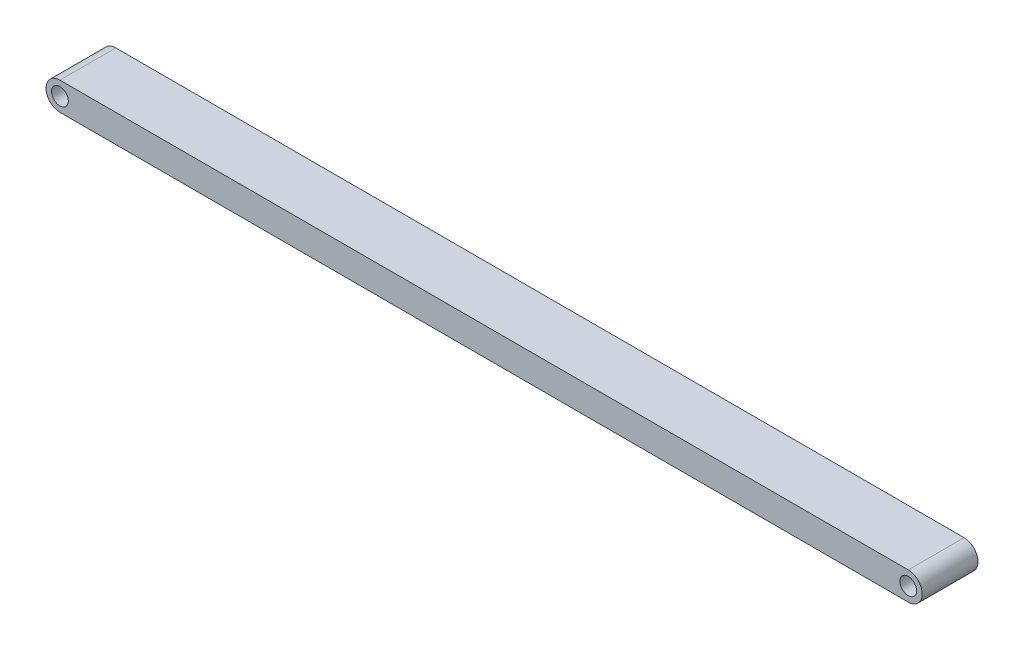
ISO-10303-21;
HEADER;
FILE_DESCRIPTION(('STEP AP214'),'2;1');
FILE_NAME('part.step','',(''),(''),'','','');
FILE_SCHEMA(('AUTOMOTIVE_DESIGN { 1 0 10303 214 1 1 1 1 }'));
ENDSEC;
DATA;
#1=APPLICATION_CONTEXT('core data for automotive mechanical design processes');
#2=APPLICATION_PROTOCOL_DEFINITION('international standard','automotive_design',2000,#1);
#3=PRODUCT_CONTEXT('',#1,'mechanical');
#4=PRODUCT('Part','Part','',(#3));
#5=PRODUCT_RELATED_PRODUCT_CATEGORY('part','',(#4));
#6=PRODUCT_DEFINITION_FORMATION('','',#4);
#7=PRODUCT_DEFINITION_CONTEXT('part definition',#1,'design');
#8=PRODUCT_DEFINITION('design','',#6,#7);
#9=PRODUCT_DEFINITION_SHAPE('','',#8);
#10=(LENGTH_UNIT() NAMED_UNIT(*) SI_UNIT(.MILLI.,.METRE.));
#11=(NAMED_UNIT(*) PLANE_ANGLE_UNIT() SI_UNIT($,.RADIAN.));
#12=(NAMED_UNIT(*) SI_UNIT($,.STERADIAN.) SOLID_ANGLE_UNIT());
#13=UNCERTAINTY_MEASURE_WITH_UNIT(LENGTH_MEASURE(1.E-05),#10,'distance_accuracy_value','');
#14=(GEOMETRIC_REPRESENTATION_CONTEXT(3) GLOBAL_UNCERTAINTY_ASSIGNED_CONTEXT((#13)) GLOBAL_UNIT_ASSIGNED_CONTEXT((#10,
#11,#12)) REPRESENTATION_CONTEXT('',''));
#15=CARTESIAN_POINT('',(0.,0.,0.));
#16=DIRECTION('',(0.,0.,1.));
#17=DIRECTION('',(1.,0.,0.));
#18=AXIS2_PLACEMENT_3D('',#15,#16,#17);
#19=CARTESIAN_POINT('',(0.,2.5,10.));
#20=DIRECTION('',(0.,0.,1.));
#21=DIRECTION('',(1.,0.,0.));
#22=AXIS2_PLACEMENT_3D('',#19,#20,#21);
#23=PLANE('',#22);
#24=CARTESIAN_POINT('',(0.,2.5,10.));
#25=DIRECTION('',(0.,0.,1.));
#26=DIRECTION('',(1.,0.,0.));
#27=AXIS2_PLACEMENT_3D('',#24,#25,#26);
#28=CIRCLE('',#27,1.5);
#29=CARTESIAN_POINT('',(1.5,2.5,10.));
#30=VERTEX_POINT('',#29);
#31=EDGE_CURVE('E100',#30,#30,#28,.T.);
#32=ORIENTED_EDGE('',*,*,#31,.F.);
#33=EDGE_LOOP('',(#32));
#34=FACE_BOUND('',#33,.T.);
#35=CARTESIAN_POINT('',(0.,2.5,10.));
#36=DIRECTION('',(0.,0.,1.));
#37=DIRECTION('',(1.,0.,0.));
#38=AXIS2_PLACEMENT_3D('',#35,#36,#37);
#39=CIRCLE('',#38,2.5);
#40=CARTESIAN_POINT('',(0.,5.,10.));
#41=VERTEX_POINT('',#40);
#42=CARTESIAN_POINT('',(0.,0.,10.));
#43=VERTEX_POINT('',#42);
#44=EDGE_CURVE('E85',#41,#43,#39,.T.);
#45=ORIENTED_EDGE('',*,*,#44,.T.);
#46=DIRECTION('',(1.,0.,0.));
#47=VECTOR('',#46,1.);
#48=CARTESIAN_POINT('',(0.,0.,10.));
#49=LINE('',#48,#47);
#50=CARTESIAN_POINT('',(152.,0.,10.));
#51=VERTEX_POINT('',#50);
#52=EDGE_CURVE('E80',#43,#51,#49,.T.);
#53=ORIENTED_EDGE('',*,*,#52,.T.);
#54=CARTESIAN_POINT('',(152.,2.5,10.));
#55=DIRECTION('',(0.,0.,1.));
#56=DIRECTION('',(-1.,0.,0.));
#57=AXIS2_PLACEMENT_3D('',#54,#55,#56);
#58=CIRCLE('',#57,2.5);
#59=CARTESIAN_POINT('',(152.,5.,10.));
#60=VERTEX_POINT('',#59);
#61=EDGE_CURVE('E83',#51,#60,#58,.T.);
#62=ORIENTED_EDGE('',*,*,#61,.T.);
#63=DIRECTION('',(-1.,0.,0.));
#64=VECTOR('',#63,1.);
#65=CARTESIAN_POINT('',(0.,5.,10.));
#66=LINE('',#65,#64);
#67=EDGE_CURVE('E50',#60,#41,#66,.T.);
#68=ORIENTED_EDGE('',*,*,#67,.T.);
#69=EDGE_LOOP('',(#45,#53,#62,#68));
#70=FACE_BOUND('',#69,.T.);
#71=CARTESIAN_POINT('',(152.,2.5,10.));
#72=DIRECTION('',(0.,0.,1.));
#73=DIRECTION('',(1.,0.,0.));
#74=AXIS2_PLACEMENT_3D('',#71,#72,#73);
#75=CIRCLE('',#74,1.5);
#76=CARTESIAN_POINT('',(153.5,2.5,10.));
#77=VERTEX_POINT('',#76);
#78=EDGE_CURVE('E115',#77,#77,#75,.T.);
#79=ORIENTED_EDGE('',*,*,#78,.F.);
#80=EDGE_LOOP('',(#79));
#81=FACE_BOUND('',#80,.T.);
#82=ADVANCED_FACE('F33',(#34,#70,#81),#23,.T.);
#83=CARTESIAN_POINT('',(0.,2.5,0.));
#84=DIRECTION('',(0.,0.,1.));
#85=DIRECTION('',(1.,0.,0.));
#86=AXIS2_PLACEMENT_3D('',#83,#84,#85);
#87=PLANE('',#86);
#88=CARTESIAN_POINT('',(0.,2.5,0.));
#89=DIRECTION('',(0.,0.,1.));
#90=DIRECTION('',(1.,0.,0.));
#91=AXIS2_PLACEMENT_3D('',#88,#89,#90);
#92=CIRCLE('',#91,2.5);
#93=CARTESIAN_POINT('',(0.,5.,0.));
#94=VERTEX_POINT('',#93);
#95=CARTESIAN_POINT('',(0.,0.,0.));
#96=VERTEX_POINT('',#95);
#97=EDGE_CURVE('E97',#94,#96,#92,.T.);
#98=ORIENTED_EDGE('',*,*,#97,.F.);
#99=DIRECTION('',(-1.,0.,0.));
#100=VECTOR('',#99,1.);
#101=CARTESIAN_POINT('',(0.,5.,0.));
#102=LINE('',#101,#100);
#103=CARTESIAN_POINT('',(152.,5.,0.));
#104=VERTEX_POINT('',#103);
#105=EDGE_CURVE('E73',#104,#94,#102,.T.);
#106=ORIENTED_EDGE('',*,*,#105,.F.);
#107=CARTESIAN_POINT('',(152.,2.5,0.));
#108=DIRECTION('',(0.,0.,1.));
#109=DIRECTION('',(-1.,0.,0.));
#110=AXIS2_PLACEMENT_3D('',#107,#108,#109);
#111=CIRCLE('',#110,2.5);
#112=CARTESIAN_POINT('',(152.,0.,0.));
#113=VERTEX_POINT('',#112);
#114=EDGE_CURVE('E67',#113,#104,#111,.T.);
#115=ORIENTED_EDGE('',*,*,#114,.F.);
#116=DIRECTION('',(1.,0.,0.));
#117=VECTOR('',#116,1.);
#118=CARTESIAN_POINT('',(0.,0.,0.));
#119=LINE('',#118,#117);
#120=EDGE_CURVE('E89',#96,#113,#119,.T.);
#121=ORIENTED_EDGE('',*,*,#120,.F.);
#122=EDGE_LOOP('',(#98,#106,#115,#121));
#123=FACE_BOUND('',#122,.T.);
#124=CARTESIAN_POINT('',(0.,2.5,0.));
#125=DIRECTION('',(0.,0.,1.));
#126=DIRECTION('',(1.,0.,0.));
#127=AXIS2_PLACEMENT_3D('',#124,#125,#126);
#128=CIRCLE('',#127,1.5);
#129=CARTESIAN_POINT('',(1.5,2.5,0.));
#130=VERTEX_POINT('',#129);
#131=EDGE_CURVE('E112',#130,#130,#128,.T.);
#132=ORIENTED_EDGE('',*,*,#131,.T.);
#133=EDGE_LOOP('',(#132));
#134=FACE_BOUND('',#133,.T.);
#135=CARTESIAN_POINT('',(152.,2.5,0.));
#136=DIRECTION('',(0.,0.,1.));
#137=DIRECTION('',(1.,0.,0.));
#138=AXIS2_PLACEMENT_3D('',#135,#136,#137);
#139=CIRCLE('',#138,1.5);
#140=CARTESIAN_POINT('',(153.5,2.5,0.));
#141=VERTEX_POINT('',#140);
#142=EDGE_CURVE('E118',#141,#141,#139,.T.);
#143=ORIENTED_EDGE('',*,*,#142,.T.);
#144=EDGE_LOOP('',(#143));
#145=FACE_BOUND('',#144,.T.);
#146=ADVANCED_FACE('F108',(#123,#134,#145),#87,.F.);
#147=CARTESIAN_POINT('',(0.,2.5,10.));
#148=DIRECTION('',(0.,0.,-1.));
#149=DIRECTION('',(-1.,0.,0.));
#150=AXIS2_PLACEMENT_3D('',#147,#148,#149);
#151=CYLINDRICAL_SURFACE('',#150,2.5);
#152=ORIENTED_EDGE('',*,*,#97,.T.);
#153=DIRECTION('',(0.,0.,-1.));
#154=VECTOR('',#153,1.);
#155=CARTESIAN_POINT('',(0.,0.,10.));
#156=LINE('',#155,#154);
#157=EDGE_CURVE('E11',#43,#96,#156,.T.);
#158=ORIENTED_EDGE('',*,*,#157,.F.);
#159=ORIENTED_EDGE('',*,*,#44,.F.);
#160=DIRECTION('',(0.,0.,-1.));
#161=VECTOR('',#160,1.);
#162=CARTESIAN_POINT('',(0.,5.,10.));
#163=LINE('',#162,#161);
#164=EDGE_CURVE('E93',#41,#94,#163,.T.);
#165=ORIENTED_EDGE('',*,*,#164,.T.);
#166=EDGE_LOOP('',(#152,#158,#159,#165));
#167=FACE_BOUND('',#166,.T.);
#168=ADVANCED_FACE('F35',(#167),#151,.T.);
#169=CARTESIAN_POINT('',(0.,0.,10.));
#170=DIRECTION('',(0.,1.,0.));
#171=DIRECTION('',(0.,0.,1.));
#172=AXIS2_PLACEMENT_3D('',#169,#170,#171);
#173=PLANE('',#172);
#174=ORIENTED_EDGE('',*,*,#120,.T.);
#175=DIRECTION('',(0.,0.,-1.));
#176=VECTOR('',#175,1.);
#177=CARTESIAN_POINT('',(152.,0.,10.));
#178=LINE('',#177,#176);
#179=EDGE_CURVE('E42',#51,#113,#178,.T.);
#180=ORIENTED_EDGE('',*,*,#179,.F.);
#181=ORIENTED_EDGE('',*,*,#52,.F.);
#182=ORIENTED_EDGE('',*,*,#157,.T.);
#183=EDGE_LOOP('',(#174,#180,#181,#182));
#184=FACE_BOUND('',#183,.T.);
#185=ADVANCED_FACE('F88',(#184),#173,.F.);
#186=CARTESIAN_POINT('',(152.,2.5,10.));
#187=DIRECTION('',(0.,0.,-1.));
#188=DIRECTION('',(-1.,0.,0.));
#189=AXIS2_PLACEMENT_3D('',#186,#187,#188);
#190=CYLINDRICAL_SURFACE('',#189,2.5);
#191=ORIENTED_EDGE('',*,*,#114,.T.);
#192=DIRECTION('',(0.,0.,-1.));
#193=VECTOR('',#192,1.);
#194=CARTESIAN_POINT('',(152.,5.,10.));
#195=LINE('',#194,#193);
#196=EDGE_CURVE('E90',#60,#104,#195,.T.);
#197=ORIENTED_EDGE('',*,*,#196,.F.);
#198=ORIENTED_EDGE('',*,*,#61,.F.);
#199=ORIENTED_EDGE('',*,*,#179,.T.);
#200=EDGE_LOOP('',(#191,#197,#198,#199));
#201=FACE_BOUND('',#200,.T.);
#202=ADVANCED_FACE('F91',(#201),#190,.T.);
#203=CARTESIAN_POINT('',(0.,5.,10.));
#204=DIRECTION('',(0.,-1.,0.));
#205=DIRECTION('',(1.,0.,0.));
#206=AXIS2_PLACEMENT_3D('',#203,#204,#205);
#207=PLANE('',#206);
#208=ORIENTED_EDGE('',*,*,#105,.T.);
#209=ORIENTED_EDGE('',*,*,#164,.F.);
#210=ORIENTED_EDGE('',*,*,#67,.F.);
#211=ORIENTED_EDGE('',*,*,#196,.T.);
#212=EDGE_LOOP('',(#208,#209,#210,#211));
#213=FACE_BOUND('',#212,.T.);
#214=ADVANCED_FACE('F105',(#213),#207,.F.);
#215=CARTESIAN_POINT('',(0.,2.5,10.));
#216=DIRECTION('',(0.,0.,-1.));
#217=DIRECTION('',(-1.,0.,0.));
#218=AXIS2_PLACEMENT_3D('',#215,#216,#217);
#219=CYLINDRICAL_SURFACE('',#218,1.5);
#220=ORIENTED_EDGE('',*,*,#31,.T.);
#221=EDGE_LOOP('',(#220));
#222=FACE_BOUND('',#221,.T.);
#223=ORIENTED_EDGE('',*,*,#131,.F.);
#224=EDGE_LOOP('',(#223));
#225=FACE_BOUND('',#224,.T.);
#226=ADVANCED_FACE('F135',(#222,#225),#219,.F.);
#227=CARTESIAN_POINT('',(152.,2.5,10.));
#228=DIRECTION('',(0.,0.,-1.));
#229=DIRECTION('',(-1.,0.,0.));
#230=AXIS2_PLACEMENT_3D('',#227,#228,#229);
#231=CYLINDRICAL_SURFACE('',#230,1.5);
#232=ORIENTED_EDGE('',*,*,#78,.T.);
#233=EDGE_LOOP('',(#232));
#234=FACE_BOUND('',#233,.T.);
#235=ORIENTED_EDGE('',*,*,#142,.F.);
#236=EDGE_LOOP('',(#235));
#237=FACE_BOUND('',#236,.T.);
#238=ADVANCED_FACE('F124',(#234,#237),#231,.F.);
#239=CLOSED_SHELL('',(#82,#146,#168,#185,#202,#214,#226,#238));
#240=MANIFOLD_SOLID_BREP('B2',#239);
#241=ADVANCED_BREP_SHAPE_REPRESENTATION('',(#18,#240),#14);
#242=SHAPE_DEFINITION_REPRESENTATION(#9,#241);
ENDSEC;
END-ISO-10303-21;
